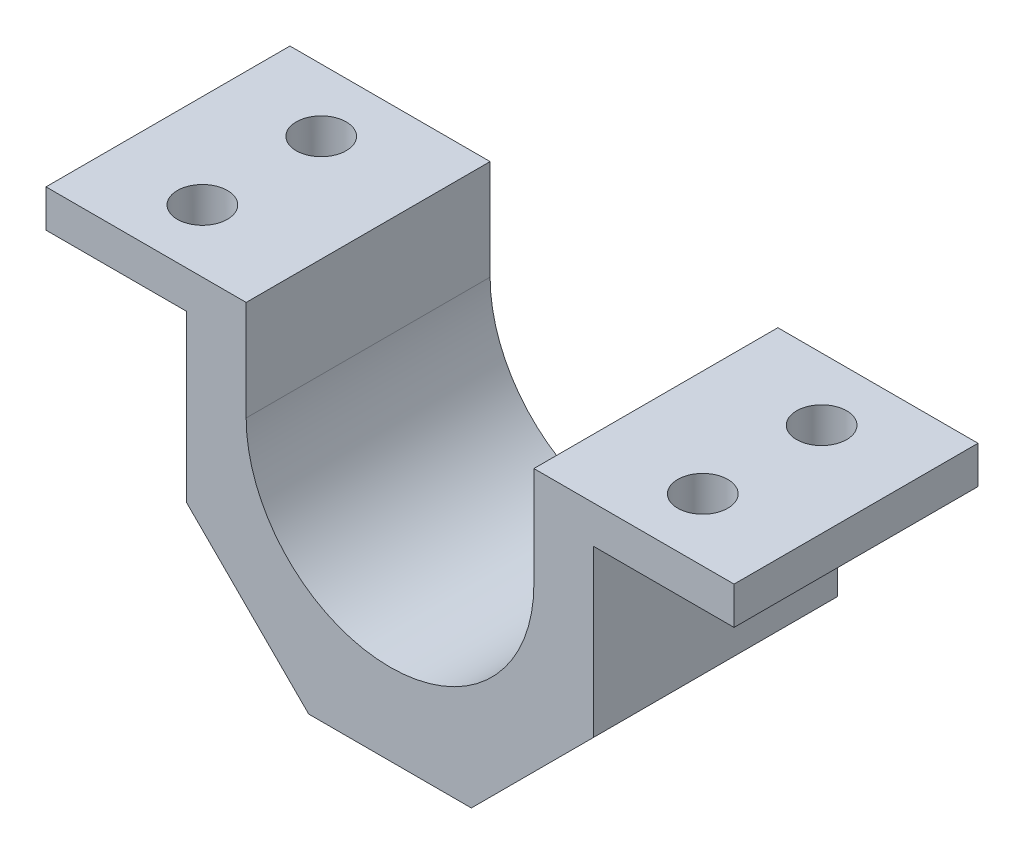
ISO-10303-21;
HEADER;
FILE_DESCRIPTION(('STEP AP214'),'2;1');
FILE_NAME('part.step','',(''),(''),'','','');
FILE_SCHEMA(('AUTOMOTIVE_DESIGN { 1 0 10303 214 1 1 1 1 }'));
ENDSEC;
DATA;
#1=APPLICATION_CONTEXT('core data for automotive mechanical design processes');
#2=APPLICATION_PROTOCOL_DEFINITION('international standard','automotive_design',2000,#1);
#3=PRODUCT_CONTEXT('',#1,'mechanical');
#4=PRODUCT('Part','Part','',(#3));
#5=PRODUCT_RELATED_PRODUCT_CATEGORY('part','',(#4));
#6=PRODUCT_DEFINITION_FORMATION('','',#4);
#7=PRODUCT_DEFINITION_CONTEXT('part definition',#1,'design');
#8=PRODUCT_DEFINITION('design','',#6,#7);
#9=PRODUCT_DEFINITION_SHAPE('','',#8);
#10=(LENGTH_UNIT() NAMED_UNIT(*) SI_UNIT(.MILLI.,.METRE.));
#11=(NAMED_UNIT(*) PLANE_ANGLE_UNIT() SI_UNIT($,.RADIAN.));
#12=(NAMED_UNIT(*) SI_UNIT($,.STERADIAN.) SOLID_ANGLE_UNIT());
#13=UNCERTAINTY_MEASURE_WITH_UNIT(LENGTH_MEASURE(1.E-05),#10,'distance_accuracy_value','');
#14=(GEOMETRIC_REPRESENTATION_CONTEXT(3) GLOBAL_UNCERTAINTY_ASSIGNED_CONTEXT((#13)) GLOBAL_UNIT_ASSIGNED_CONTEXT((#10,
#11,#12)) REPRESENTATION_CONTEXT('',''));
#15=CARTESIAN_POINT('',(0.,0.,0.));
#16=DIRECTION('',(0.,0.,1.));
#17=DIRECTION('',(1.,0.,0.));
#18=AXIS2_PLACEMENT_3D('',#15,#16,#17);
#19=CARTESIAN_POINT('',(-55.,16.,19.5));
#20=DIRECTION('',(1.,0.,0.));
#21=DIRECTION('',(0.,1.,0.));
#22=AXIS2_PLACEMENT_3D('',#19,#20,#21);
#23=PLANE('',#22);
#24=DIRECTION('',(0.,-1.,0.));
#25=VECTOR('',#24,1.);
#26=CARTESIAN_POINT('',(-55.,16.,-19.5));
#27=LINE('',#26,#25);
#28=CARTESIAN_POINT('',(-55.,16.,-19.5));
#29=VERTEX_POINT('',#28);
#30=CARTESIAN_POINT('',(-55.,10.,-19.5));
#31=VERTEX_POINT('',#30);
#32=EDGE_CURVE('E180',#29,#31,#27,.T.);
#33=ORIENTED_EDGE('',*,*,#32,.T.);
#34=DIRECTION('',(0.,0.,-1.));
#35=VECTOR('',#34,1.);
#36=CARTESIAN_POINT('',(-55.,10.,19.5));
#37=LINE('',#36,#35);
#38=CARTESIAN_POINT('',(-55.,10.,19.5));
#39=VERTEX_POINT('',#38);
#40=EDGE_CURVE('E11',#39,#31,#37,.T.);
#41=ORIENTED_EDGE('',*,*,#40,.F.);
#42=DIRECTION('',(0.,-1.,0.));
#43=VECTOR('',#42,1.);
#44=CARTESIAN_POINT('',(-55.,16.,19.5));
#45=LINE('',#44,#43);
#46=CARTESIAN_POINT('',(-55.,16.,19.5));
#47=VERTEX_POINT('',#46);
#48=EDGE_CURVE('E221',#47,#39,#45,.T.);
#49=ORIENTED_EDGE('',*,*,#48,.F.);
#50=DIRECTION('',(0.,0.,-1.));
#51=VECTOR('',#50,1.);
#52=CARTESIAN_POINT('',(-55.,16.,19.5));
#53=LINE('',#52,#51);
#54=EDGE_CURVE('E176',#47,#29,#53,.T.);
#55=ORIENTED_EDGE('',*,*,#54,.T.);
#56=EDGE_LOOP('',(#33,#41,#49,#55));
#57=FACE_BOUND('',#56,.T.);
#58=ADVANCED_FACE('F43',(#57),#23,.F.);
#59=CARTESIAN_POINT('',(-55.,10.,19.5));
#60=DIRECTION('',(0.,1.,0.));
#61=DIRECTION('',(0.,0.,1.));
#62=AXIS2_PLACEMENT_3D('',#59,#60,#61);
#63=PLANE('',#62);
#64=CARTESIAN_POINT('',(-40.,10.,-9.5));
#65=DIRECTION('',(0.,1.,0.));
#66=DIRECTION('',(0.,0.,1.));
#67=AXIS2_PLACEMENT_3D('',#64,#65,#66);
#68=CIRCLE('',#67,4.);
#69=CARTESIAN_POINT('',(-40.,10.,-5.5));
#70=VERTEX_POINT('',#69);
#71=EDGE_CURVE('E552',#70,#70,#68,.T.);
#72=ORIENTED_EDGE('',*,*,#71,.T.);
#73=EDGE_LOOP('',(#72));
#74=FACE_BOUND('',#73,.T.);
#75=CARTESIAN_POINT('',(-40.,10.,9.5));
#76=DIRECTION('',(0.,1.,0.));
#77=DIRECTION('',(0.,0.,1.));
#78=AXIS2_PLACEMENT_3D('',#75,#76,#77);
#79=CIRCLE('',#78,4.);
#80=CARTESIAN_POINT('',(-40.,10.,13.5));
#81=VERTEX_POINT('',#80);
#82=EDGE_CURVE('E562',#81,#81,#79,.T.);
#83=ORIENTED_EDGE('',*,*,#82,.T.);
#84=EDGE_LOOP('',(#83));
#85=FACE_BOUND('',#84,.T.);
#86=DIRECTION('',(1.,0.,0.));
#87=VECTOR('',#86,1.);
#88=CARTESIAN_POINT('',(-55.,10.,-19.5));
#89=LINE('',#88,#87);
#90=CARTESIAN_POINT('',(-32.5,10.,-19.5));
#91=VERTEX_POINT('',#90);
#92=EDGE_CURVE('E184',#31,#91,#89,.T.);
#93=ORIENTED_EDGE('',*,*,#92,.T.);
#94=DIRECTION('',(0.,0.,-1.));
#95=VECTOR('',#94,1.);
#96=CARTESIAN_POINT('',(-32.5,10.,19.5));
#97=LINE('',#96,#95);
#98=CARTESIAN_POINT('',(-32.5,10.,19.5));
#99=VERTEX_POINT('',#98);
#100=EDGE_CURVE('E52',#99,#91,#97,.T.);
#101=ORIENTED_EDGE('',*,*,#100,.F.);
#102=DIRECTION('',(1.,0.,0.));
#103=VECTOR('',#102,1.);
#104=CARTESIAN_POINT('',(-55.,10.,19.5));
#105=LINE('',#104,#103);
#106=EDGE_CURVE('E121',#39,#99,#105,.T.);
#107=ORIENTED_EDGE('',*,*,#106,.F.);
#108=ORIENTED_EDGE('',*,*,#40,.T.);
#109=EDGE_LOOP('',(#93,#101,#107,#108));
#110=FACE_BOUND('',#109,.T.);
#111=ADVANCED_FACE('F332',(#74,#85,#110),#63,.F.);
#112=CARTESIAN_POINT('',(-32.5,10.,19.5));
#113=DIRECTION('',(1.,0.,0.));
#114=DIRECTION('',(0.,0.,-1.));
#115=AXIS2_PLACEMENT_3D('',#112,#113,#114);
#116=PLANE('',#115);
#117=DIRECTION('',(0.,-1.,0.));
#118=VECTOR('',#117,1.);
#119=CARTESIAN_POINT('',(-32.5,10.,-19.5));
#120=LINE('',#119,#118);
#121=CARTESIAN_POINT('',(-32.5,-16.4999999999999,-19.5));
#122=VERTEX_POINT('',#121);
#123=EDGE_CURVE('E188',#91,#122,#120,.T.);
#124=ORIENTED_EDGE('',*,*,#123,.T.);
#125=DIRECTION('',(0.,0.,-1.));
#126=VECTOR('',#125,1.);
#127=CARTESIAN_POINT('',(-32.5,-16.4999999999999,19.5));
#128=LINE('',#127,#126);
#129=CARTESIAN_POINT('',(-32.5,-16.4999999999999,19.5));
#130=VERTEX_POINT('',#129);
#131=EDGE_CURVE('E256',#130,#122,#128,.T.);
#132=ORIENTED_EDGE('',*,*,#131,.F.);
#133=DIRECTION('',(0.,-1.,0.));
#134=VECTOR('',#133,1.);
#135=CARTESIAN_POINT('',(-32.5,10.,19.5));
#136=LINE('',#135,#134);
#137=EDGE_CURVE('E266',#99,#130,#136,.T.);
#138=ORIENTED_EDGE('',*,*,#137,.F.);
#139=ORIENTED_EDGE('',*,*,#100,.T.);
#140=EDGE_LOOP('',(#124,#132,#138,#139));
#141=FACE_BOUND('',#140,.T.);
#142=ADVANCED_FACE('F264',(#141),#116,.F.);
#143=CARTESIAN_POINT('',(-32.5,-16.4999999999999,19.5));
#144=DIRECTION('',(0.707106781186549,0.707106781186546,0.));
#145=DIRECTION('',(-0.707106781186546,0.707106781186549,0.));
#146=AXIS2_PLACEMENT_3D('',#143,#144,#145);
#147=PLANE('',#146);
#148=DIRECTION('',(0.707106781186546,-0.707106781186549,0.));
#149=VECTOR('',#148,1.);
#150=CARTESIAN_POINT('',(-32.5,-16.4999999999999,-19.5));
#151=LINE('',#150,#149);
#152=CARTESIAN_POINT('',(-13.,-36.,-19.5));
#153=VERTEX_POINT('',#152);
#154=EDGE_CURVE('E191',#122,#153,#151,.T.);
#155=ORIENTED_EDGE('',*,*,#154,.T.);
#156=DIRECTION('',(0.,0.,-1.));
#157=VECTOR('',#156,1.);
#158=CARTESIAN_POINT('',(-13.,-36.,19.5));
#159=LINE('',#158,#157);
#160=CARTESIAN_POINT('',(-13.,-36.,19.5));
#161=VERTEX_POINT('',#160);
#162=EDGE_CURVE('E252',#161,#153,#159,.T.);
#163=ORIENTED_EDGE('',*,*,#162,.F.);
#164=DIRECTION('',(0.707106781186546,-0.707106781186549,0.));
#165=VECTOR('',#164,1.);
#166=CARTESIAN_POINT('',(-32.5,-16.4999999999999,19.5));
#167=LINE('',#166,#165);
#168=EDGE_CURVE('E285',#130,#161,#167,.T.);
#169=ORIENTED_EDGE('',*,*,#168,.F.);
#170=ORIENTED_EDGE('',*,*,#131,.T.);
#171=EDGE_LOOP('',(#155,#163,#169,#170));
#172=FACE_BOUND('',#171,.T.);
#173=ADVANCED_FACE('F275',(#172),#147,.F.);
#174=CARTESIAN_POINT('',(-13.,-36.,19.5));
#175=DIRECTION('',(0.,1.,0.));
#176=DIRECTION('',(0.,0.,1.));
#177=AXIS2_PLACEMENT_3D('',#174,#175,#176);
#178=PLANE('',#177);
#179=DIRECTION('',(1.,0.,0.));
#180=VECTOR('',#179,1.);
#181=CARTESIAN_POINT('',(-13.,-36.,-19.5));
#182=LINE('',#181,#180);
#183=CARTESIAN_POINT('',(13.,-36.,-19.5));
#184=VERTEX_POINT('',#183);
#185=EDGE_CURVE('E194',#153,#184,#182,.T.);
#186=ORIENTED_EDGE('',*,*,#185,.T.);
#187=DIRECTION('',(0.,0.,-1.));
#188=VECTOR('',#187,1.);
#189=CARTESIAN_POINT('',(13.,-36.,19.5));
#190=LINE('',#189,#188);
#191=CARTESIAN_POINT('',(13.,-36.,19.5));
#192=VERTEX_POINT('',#191);
#193=EDGE_CURVE('E248',#192,#184,#190,.T.);
#194=ORIENTED_EDGE('',*,*,#193,.F.);
#195=DIRECTION('',(1.,0.,0.));
#196=VECTOR('',#195,1.);
#197=CARTESIAN_POINT('',(-13.,-36.,19.5));
#198=LINE('',#197,#196);
#199=EDGE_CURVE('E281',#161,#192,#198,.T.);
#200=ORIENTED_EDGE('',*,*,#199,.F.);
#201=ORIENTED_EDGE('',*,*,#162,.T.);
#202=EDGE_LOOP('',(#186,#194,#200,#201));
#203=FACE_BOUND('',#202,.T.);
#204=ADVANCED_FACE('F279',(#203),#178,.F.);
#205=CARTESIAN_POINT('',(13.,-36.,19.5));
#206=DIRECTION('',(-0.707106781186549,0.707106781186546,0.));
#207=DIRECTION('',(-0.707106781186546,-0.707106781186549,0.));
#208=AXIS2_PLACEMENT_3D('',#205,#206,#207);
#209=PLANE('',#208);
#210=DIRECTION('',(0.707106781186546,0.707106781186549,0.));
#211=VECTOR('',#210,1.);
#212=CARTESIAN_POINT('',(13.,-36.,-19.5));
#213=LINE('',#212,#211);
#214=CARTESIAN_POINT('',(32.5,-16.4999999999999,-19.5));
#215=VERTEX_POINT('',#214);
#216=EDGE_CURVE('E197',#184,#215,#213,.T.);
#217=ORIENTED_EDGE('',*,*,#216,.T.);
#218=DIRECTION('',(0.,0.,-1.));
#219=VECTOR('',#218,1.);
#220=CARTESIAN_POINT('',(32.5,-16.4999999999999,19.5));
#221=LINE('',#220,#219);
#222=CARTESIAN_POINT('',(32.5,-16.4999999999999,19.5));
#223=VERTEX_POINT('',#222);
#224=EDGE_CURVE('E244',#223,#215,#221,.T.);
#225=ORIENTED_EDGE('',*,*,#224,.F.);
#226=DIRECTION('',(0.707106781186546,0.707106781186549,0.));
#227=VECTOR('',#226,1.);
#228=CARTESIAN_POINT('',(13.,-36.,19.5));
#229=LINE('',#228,#227);
#230=EDGE_CURVE('E284',#192,#223,#229,.T.);
#231=ORIENTED_EDGE('',*,*,#230,.F.);
#232=ORIENTED_EDGE('',*,*,#193,.T.);
#233=EDGE_LOOP('',(#217,#225,#231,#232));
#234=FACE_BOUND('',#233,.T.);
#235=ADVANCED_FACE('F348',(#234),#209,.F.);
#236=CARTESIAN_POINT('',(32.5,-16.4999999999999,19.5));
#237=DIRECTION('',(-1.,0.,0.));
#238=DIRECTION('',(0.,0.,1.));
#239=AXIS2_PLACEMENT_3D('',#236,#237,#238);
#240=PLANE('',#239);
#241=DIRECTION('',(0.,1.,0.));
#242=VECTOR('',#241,1.);
#243=CARTESIAN_POINT('',(32.5,-16.4999999999999,-19.5));
#244=LINE('',#243,#242);
#245=CARTESIAN_POINT('',(32.5,10.,-19.5));
#246=VERTEX_POINT('',#245);
#247=EDGE_CURVE('E200',#215,#246,#244,.T.);
#248=ORIENTED_EDGE('',*,*,#247,.T.);
#249=DIRECTION('',(0.,0.,-1.));
#250=VECTOR('',#249,1.);
#251=CARTESIAN_POINT('',(32.5,10.,19.5));
#252=LINE('',#251,#250);
#253=CARTESIAN_POINT('',(32.5,10.,19.5));
#254=VERTEX_POINT('',#253);
#255=EDGE_CURVE('E240',#254,#246,#252,.T.);
#256=ORIENTED_EDGE('',*,*,#255,.F.);
#257=DIRECTION('',(0.,1.,0.));
#258=VECTOR('',#257,1.);
#259=CARTESIAN_POINT('',(32.5,-16.4999999999999,19.5));
#260=LINE('',#259,#258);
#261=EDGE_CURVE('E289',#223,#254,#260,.T.);
#262=ORIENTED_EDGE('',*,*,#261,.F.);
#263=ORIENTED_EDGE('',*,*,#224,.T.);
#264=EDGE_LOOP('',(#248,#256,#262,#263));
#265=FACE_BOUND('',#264,.T.);
#266=ADVANCED_FACE('F351',(#265),#240,.F.);
#267=CARTESIAN_POINT('',(32.5,10.,19.5));
#268=DIRECTION('',(0.,1.,0.));
#269=DIRECTION('',(0.,0.,1.));
#270=AXIS2_PLACEMENT_3D('',#267,#268,#269);
#271=PLANE('',#270);
#272=CARTESIAN_POINT('',(40.,10.,9.5));
#273=DIRECTION('',(0.,1.,0.));
#274=DIRECTION('',(0.,0.,1.));
#275=AXIS2_PLACEMENT_3D('',#272,#273,#274);
#276=CIRCLE('',#275,4.);
#277=CARTESIAN_POINT('',(40.,10.,13.5));
#278=VERTEX_POINT('',#277);
#279=EDGE_CURVE('E185',#278,#278,#276,.T.);
#280=ORIENTED_EDGE('',*,*,#279,.T.);
#281=EDGE_LOOP('',(#280));
#282=FACE_BOUND('',#281,.T.);
#283=CARTESIAN_POINT('',(40.,10.,-9.5));
#284=DIRECTION('',(0.,1.,0.));
#285=DIRECTION('',(0.,0.,1.));
#286=AXIS2_PLACEMENT_3D('',#283,#284,#285);
#287=CIRCLE('',#286,4.);
#288=CARTESIAN_POINT('',(40.,10.,-5.5));
#289=VERTEX_POINT('',#288);
#290=EDGE_CURVE('E548',#289,#289,#287,.T.);
#291=ORIENTED_EDGE('',*,*,#290,.T.);
#292=EDGE_LOOP('',(#291));
#293=FACE_BOUND('',#292,.T.);
#294=DIRECTION('',(1.,0.,0.));
#295=VECTOR('',#294,1.);
#296=CARTESIAN_POINT('',(32.5,10.,-19.5));
#297=LINE('',#296,#295);
#298=CARTESIAN_POINT('',(55.,10.,-19.5));
#299=VERTEX_POINT('',#298);
#300=EDGE_CURVE('E203',#246,#299,#297,.T.);
#301=ORIENTED_EDGE('',*,*,#300,.T.);
#302=DIRECTION('',(0.,0.,-1.));
#303=VECTOR('',#302,1.);
#304=CARTESIAN_POINT('',(55.,10.,19.5));
#305=LINE('',#304,#303);
#306=CARTESIAN_POINT('',(55.,10.,19.5));
#307=VERTEX_POINT('',#306);
#308=EDGE_CURVE('E236',#307,#299,#305,.T.);
#309=ORIENTED_EDGE('',*,*,#308,.F.);
#310=DIRECTION('',(1.,0.,0.));
#311=VECTOR('',#310,1.);
#312=CARTESIAN_POINT('',(32.5,10.,19.5));
#313=LINE('',#312,#311);
#314=EDGE_CURVE('E296',#254,#307,#313,.T.);
#315=ORIENTED_EDGE('',*,*,#314,.F.);
#316=ORIENTED_EDGE('',*,*,#255,.T.);
#317=EDGE_LOOP('',(#301,#309,#315,#316));
#318=FACE_BOUND('',#317,.T.);
#319=ADVANCED_FACE('F355',(#282,#293,#318),#271,.F.);
#320=CARTESIAN_POINT('',(55.,10.,19.5));
#321=DIRECTION('',(-1.,0.,0.));
#322=DIRECTION('',(0.,-1.,0.));
#323=AXIS2_PLACEMENT_3D('',#320,#321,#322);
#324=PLANE('',#323);
#325=DIRECTION('',(0.,1.,0.));
#326=VECTOR('',#325,1.);
#327=CARTESIAN_POINT('',(55.,10.,-19.5));
#328=LINE('',#327,#326);
#329=CARTESIAN_POINT('',(55.,16.,-19.5));
#330=VERTEX_POINT('',#329);
#331=EDGE_CURVE('E206',#299,#330,#328,.T.);
#332=ORIENTED_EDGE('',*,*,#331,.T.);
#333=DIRECTION('',(0.,0.,-1.));
#334=VECTOR('',#333,1.);
#335=CARTESIAN_POINT('',(55.,16.,19.5));
#336=LINE('',#335,#334);
#337=CARTESIAN_POINT('',(55.,16.,19.5));
#338=VERTEX_POINT('',#337);
#339=EDGE_CURVE('E232',#338,#330,#336,.T.);
#340=ORIENTED_EDGE('',*,*,#339,.F.);
#341=DIRECTION('',(0.,1.,0.));
#342=VECTOR('',#341,1.);
#343=CARTESIAN_POINT('',(55.,10.,19.5));
#344=LINE('',#343,#342);
#345=EDGE_CURVE('E299',#307,#338,#344,.T.);
#346=ORIENTED_EDGE('',*,*,#345,.F.);
#347=ORIENTED_EDGE('',*,*,#308,.T.);
#348=EDGE_LOOP('',(#332,#340,#346,#347));
#349=FACE_BOUND('',#348,.T.);
#350=ADVANCED_FACE('F359',(#349),#324,.F.);
#351=CARTESIAN_POINT('',(23.,16.,19.5));
#352=DIRECTION('',(0.,-1.,0.));
#353=DIRECTION('',(0.,0.,-1.));
#354=AXIS2_PLACEMENT_3D('',#351,#352,#353);
#355=PLANE('',#354);
#356=CARTESIAN_POINT('',(40.,16.,9.5));
#357=DIRECTION('',(0.,1.,0.));
#358=DIRECTION('',(0.,0.,1.));
#359=AXIS2_PLACEMENT_3D('',#356,#357,#358);
#360=CIRCLE('',#359,4.);
#361=CARTESIAN_POINT('',(40.,16.,13.5));
#362=VERTEX_POINT('',#361);
#363=EDGE_CURVE('E544',#362,#362,#360,.T.);
#364=ORIENTED_EDGE('',*,*,#363,.F.);
#365=EDGE_LOOP('',(#364));
#366=FACE_BOUND('',#365,.T.);
#367=CARTESIAN_POINT('',(40.,16.,-9.5));
#368=DIRECTION('',(0.,1.,0.));
#369=DIRECTION('',(0.,0.,1.));
#370=AXIS2_PLACEMENT_3D('',#367,#368,#369);
#371=CIRCLE('',#370,4.);
#372=CARTESIAN_POINT('',(40.,16.,-5.5));
#373=VERTEX_POINT('',#372);
#374=EDGE_CURVE('E566',#373,#373,#371,.T.);
#375=ORIENTED_EDGE('',*,*,#374,.F.);
#376=EDGE_LOOP('',(#375));
#377=FACE_BOUND('',#376,.T.);
#378=DIRECTION('',(-1.,0.,0.));
#379=VECTOR('',#378,1.);
#380=CARTESIAN_POINT('',(23.,16.,-19.5));
#381=LINE('',#380,#379);
#382=CARTESIAN_POINT('',(23.,16.,-19.5));
#383=VERTEX_POINT('',#382);
#384=EDGE_CURVE('E209',#330,#383,#381,.T.);
#385=ORIENTED_EDGE('',*,*,#384,.T.);
#386=DIRECTION('',(0.,0.,-1.));
#387=VECTOR('',#386,1.);
#388=CARTESIAN_POINT('',(23.,16.,19.5));
#389=LINE('',#388,#387);
#390=CARTESIAN_POINT('',(23.,16.,19.5));
#391=VERTEX_POINT('',#390);
#392=EDGE_CURVE('E228',#391,#383,#389,.T.);
#393=ORIENTED_EDGE('',*,*,#392,.F.);
#394=DIRECTION('',(-1.,0.,0.));
#395=VECTOR('',#394,1.);
#396=CARTESIAN_POINT('',(23.,16.,19.5));
#397=LINE('',#396,#395);
#398=EDGE_CURVE('E302',#338,#391,#397,.T.);
#399=ORIENTED_EDGE('',*,*,#398,.F.);
#400=ORIENTED_EDGE('',*,*,#339,.T.);
#401=EDGE_LOOP('',(#385,#393,#399,#400));
#402=FACE_BOUND('',#401,.T.);
#403=ADVANCED_FACE('F310',(#366,#377,#402),#355,.F.);
#404=CARTESIAN_POINT('',(23.,0.,19.5));
#405=DIRECTION('',(1.,0.,0.));
#406=DIRECTION('',(0.,0.,-1.));
#407=AXIS2_PLACEMENT_3D('',#404,#405,#406);
#408=PLANE('',#407);
#409=DIRECTION('',(0.,-1.,0.));
#410=VECTOR('',#409,1.);
#411=CARTESIAN_POINT('',(23.,0.,-19.5));
#412=LINE('',#411,#410);
#413=CARTESIAN_POINT('',(23.,0.,-19.5));
#414=VERTEX_POINT('',#413);
#415=EDGE_CURVE('E212',#383,#414,#412,.T.);
#416=ORIENTED_EDGE('',*,*,#415,.T.);
#417=DIRECTION('',(0.,0.,-1.));
#418=VECTOR('',#417,1.);
#419=CARTESIAN_POINT('',(23.,0.,19.5));
#420=LINE('',#419,#418);
#421=CARTESIAN_POINT('',(23.,0.,19.5));
#422=VERTEX_POINT('',#421);
#423=EDGE_CURVE('E169',#422,#414,#420,.T.);
#424=ORIENTED_EDGE('',*,*,#423,.F.);
#425=DIRECTION('',(0.,-1.,0.));
#426=VECTOR('',#425,1.);
#427=CARTESIAN_POINT('',(23.,0.,19.5));
#428=LINE('',#427,#426);
#429=EDGE_CURVE('E158',#391,#422,#428,.T.);
#430=ORIENTED_EDGE('',*,*,#429,.F.);
#431=ORIENTED_EDGE('',*,*,#392,.T.);
#432=EDGE_LOOP('',(#416,#424,#430,#431));
#433=FACE_BOUND('',#432,.T.);
#434=ADVANCED_FACE('F314',(#433),#408,.F.);
#435=CARTESIAN_POINT('',(0.,0.,19.5));
#436=DIRECTION('',(0.,0.,-1.));
#437=DIRECTION('',(-1.,0.,0.));
#438=AXIS2_PLACEMENT_3D('',#435,#436,#437);
#439=CYLINDRICAL_SURFACE('',#438,23.);
#440=CARTESIAN_POINT('',(0.,0.,-19.5));
#441=DIRECTION('',(0.,0.,-1.));
#442=DIRECTION('',(1.,0.,0.));
#443=AXIS2_PLACEMENT_3D('',#440,#441,#442);
#444=CIRCLE('',#443,23.);
#445=CARTESIAN_POINT('',(-23.,0.,-19.5));
#446=VERTEX_POINT('',#445);
#447=EDGE_CURVE('E167',#414,#446,#444,.T.);
#448=ORIENTED_EDGE('',*,*,#447,.T.);
#449=DIRECTION('',(0.,0.,-1.));
#450=VECTOR('',#449,1.);
#451=CARTESIAN_POINT('',(-23.,0.,19.5));
#452=LINE('',#451,#450);
#453=CARTESIAN_POINT('',(-23.,0.,19.5));
#454=VERTEX_POINT('',#453);
#455=EDGE_CURVE('E164',#454,#446,#452,.T.);
#456=ORIENTED_EDGE('',*,*,#455,.F.);
#457=CARTESIAN_POINT('',(0.,0.,19.5));
#458=DIRECTION('',(0.,0.,-1.));
#459=DIRECTION('',(1.,0.,0.));
#460=AXIS2_PLACEMENT_3D('',#457,#458,#459);
#461=CIRCLE('',#460,23.);
#462=EDGE_CURVE('E152',#422,#454,#461,.T.);
#463=ORIENTED_EDGE('',*,*,#462,.F.);
#464=ORIENTED_EDGE('',*,*,#423,.T.);
#465=EDGE_LOOP('',(#448,#456,#463,#464));
#466=FACE_BOUND('',#465,.T.);
#467=ADVANCED_FACE('F165',(#466),#439,.F.);
#468=CARTESIAN_POINT('',(-23.,0.,19.5));
#469=DIRECTION('',(-1.,0.,0.));
#470=DIRECTION('',(0.,0.,1.));
#471=AXIS2_PLACEMENT_3D('',#468,#469,#470);
#472=PLANE('',#471);
#473=DIRECTION('',(0.,1.,0.));
#474=VECTOR('',#473,1.);
#475=CARTESIAN_POINT('',(-23.,0.,-19.5));
#476=LINE('',#475,#474);
#477=CARTESIAN_POINT('',(-23.,16.,-19.5));
#478=VERTEX_POINT('',#477);
#479=EDGE_CURVE('E107',#446,#478,#476,.T.);
#480=ORIENTED_EDGE('',*,*,#479,.T.);
#481=DIRECTION('',(0.,0.,-1.));
#482=VECTOR('',#481,1.);
#483=CARTESIAN_POINT('',(-23.,16.,19.5));
#484=LINE('',#483,#482);
#485=CARTESIAN_POINT('',(-23.,16.,19.5));
#486=VERTEX_POINT('',#485);
#487=EDGE_CURVE('E170',#486,#478,#484,.T.);
#488=ORIENTED_EDGE('',*,*,#487,.F.);
#489=DIRECTION('',(0.,1.,0.));
#490=VECTOR('',#489,1.);
#491=CARTESIAN_POINT('',(-23.,0.,19.5));
#492=LINE('',#491,#490);
#493=EDGE_CURVE('E156',#454,#486,#492,.T.);
#494=ORIENTED_EDGE('',*,*,#493,.F.);
#495=ORIENTED_EDGE('',*,*,#455,.T.);
#496=EDGE_LOOP('',(#480,#488,#494,#495));
#497=FACE_BOUND('',#496,.T.);
#498=ADVANCED_FACE('F172',(#497),#472,.F.);
#499=CARTESIAN_POINT('',(-55.,16.,19.5));
#500=DIRECTION('',(0.,-1.,0.));
#501=DIRECTION('',(0.,0.,-1.));
#502=AXIS2_PLACEMENT_3D('',#499,#500,#501);
#503=PLANE('',#502);
#504=CARTESIAN_POINT('',(-40.,16.,-9.5));
#505=DIRECTION('',(0.,1.,0.));
#506=DIRECTION('',(0.,0.,-1.));
#507=AXIS2_PLACEMENT_3D('',#504,#505,#506);
#508=CIRCLE('',#507,4.);
#509=CARTESIAN_POINT('',(-40.,16.,-13.5));
#510=VERTEX_POINT('',#509);
#511=EDGE_CURVE('E570',#510,#510,#508,.T.);
#512=ORIENTED_EDGE('',*,*,#511,.F.);
#513=EDGE_LOOP('',(#512));
#514=FACE_BOUND('',#513,.T.);
#515=CARTESIAN_POINT('',(-40.,16.,9.5));
#516=DIRECTION('',(0.,1.,0.));
#517=DIRECTION('',(0.,0.,-1.));
#518=AXIS2_PLACEMENT_3D('',#515,#516,#517);
#519=CIRCLE('',#518,4.);
#520=CARTESIAN_POINT('',(-40.,16.,5.5));
#521=VERTEX_POINT('',#520);
#522=EDGE_CURVE('E574',#521,#521,#519,.T.);
#523=ORIENTED_EDGE('',*,*,#522,.F.);
#524=EDGE_LOOP('',(#523));
#525=FACE_BOUND('',#524,.T.);
#526=DIRECTION('',(-1.,0.,0.));
#527=VECTOR('',#526,1.);
#528=CARTESIAN_POINT('',(-55.,16.,-19.5));
#529=LINE('',#528,#527);
#530=EDGE_CURVE('E113',#478,#29,#529,.T.);
#531=ORIENTED_EDGE('',*,*,#530,.T.);
#532=ORIENTED_EDGE('',*,*,#54,.F.);
#533=DIRECTION('',(-1.,0.,0.));
#534=VECTOR('',#533,1.);
#535=CARTESIAN_POINT('',(-55.,16.,19.5));
#536=LINE('',#535,#534);
#537=EDGE_CURVE('E60',#486,#47,#536,.T.);
#538=ORIENTED_EDGE('',*,*,#537,.F.);
#539=ORIENTED_EDGE('',*,*,#487,.T.);
#540=EDGE_LOOP('',(#531,#532,#538,#539));
#541=FACE_BOUND('',#540,.T.);
#542=ADVANCED_FACE('F318',(#514,#525,#541),#503,.F.);
#543=CARTESIAN_POINT('',(0.,0.,19.5));
#544=DIRECTION('',(0.,0.,1.));
#545=DIRECTION('',(1.,0.,0.));
#546=AXIS2_PLACEMENT_3D('',#543,#544,#545);
#547=PLANE('',#546);
#548=ORIENTED_EDGE('',*,*,#48,.T.);
#549=ORIENTED_EDGE('',*,*,#106,.T.);
#550=ORIENTED_EDGE('',*,*,#137,.T.);
#551=ORIENTED_EDGE('',*,*,#168,.T.);
#552=ORIENTED_EDGE('',*,*,#199,.T.);
#553=ORIENTED_EDGE('',*,*,#230,.T.);
#554=ORIENTED_EDGE('',*,*,#261,.T.);
#555=ORIENTED_EDGE('',*,*,#314,.T.);
#556=ORIENTED_EDGE('',*,*,#345,.T.);
#557=ORIENTED_EDGE('',*,*,#398,.T.);
#558=ORIENTED_EDGE('',*,*,#429,.T.);
#559=ORIENTED_EDGE('',*,*,#462,.T.);
#560=ORIENTED_EDGE('',*,*,#493,.T.);
#561=ORIENTED_EDGE('',*,*,#537,.T.);
#562=EDGE_LOOP('',(#548,#549,#550,#551,#552,#553,#554,#555,#556,#557,#558,#559,#560,#561));
#563=FACE_BOUND('',#562,.T.);
#564=ADVANCED_FACE('F154',(#563),#547,.T.);
#565=CARTESIAN_POINT('',(0.,0.,-19.5));
#566=DIRECTION('',(0.,0.,1.));
#567=DIRECTION('',(1.,0.,0.));
#568=AXIS2_PLACEMENT_3D('',#565,#566,#567);
#569=PLANE('',#568);
#570=ORIENTED_EDGE('',*,*,#32,.F.);
#571=ORIENTED_EDGE('',*,*,#530,.F.);
#572=ORIENTED_EDGE('',*,*,#479,.F.);
#573=ORIENTED_EDGE('',*,*,#447,.F.);
#574=ORIENTED_EDGE('',*,*,#415,.F.);
#575=ORIENTED_EDGE('',*,*,#384,.F.);
#576=ORIENTED_EDGE('',*,*,#331,.F.);
#577=ORIENTED_EDGE('',*,*,#300,.F.);
#578=ORIENTED_EDGE('',*,*,#247,.F.);
#579=ORIENTED_EDGE('',*,*,#216,.F.);
#580=ORIENTED_EDGE('',*,*,#185,.F.);
#581=ORIENTED_EDGE('',*,*,#154,.F.);
#582=ORIENTED_EDGE('',*,*,#123,.F.);
#583=ORIENTED_EDGE('',*,*,#92,.F.);
#584=EDGE_LOOP('',(#570,#571,#572,#573,#574,#575,#576,#577,#578,#579,#580,#581,#582,#583));
#585=FACE_BOUND('',#584,.T.);
#586=ADVANCED_FACE('F270',(#585),#569,.F.);
#587=CARTESIAN_POINT('',(-40.,-23.,9.5));
#588=DIRECTION('',(0.,1.,0.));
#589=DIRECTION('',(0.,0.,1.));
#590=AXIS2_PLACEMENT_3D('',#587,#588,#589);
#591=CYLINDRICAL_SURFACE('',#590,4.);
#592=ORIENTED_EDGE('',*,*,#522,.T.);
#593=EDGE_LOOP('',(#592));
#594=FACE_BOUND('',#593,.T.);
#595=ORIENTED_EDGE('',*,*,#82,.F.);
#596=EDGE_LOOP('',(#595));
#597=FACE_BOUND('',#596,.T.);
#598=ADVANCED_FACE('F395',(#594,#597),#591,.F.);
#599=CARTESIAN_POINT('',(-40.,-23.,-9.5));
#600=DIRECTION('',(0.,1.,0.));
#601=DIRECTION('',(0.,0.,1.));
#602=AXIS2_PLACEMENT_3D('',#599,#600,#601);
#603=CYLINDRICAL_SURFACE('',#602,4.);
#604=ORIENTED_EDGE('',*,*,#511,.T.);
#605=EDGE_LOOP('',(#604));
#606=FACE_BOUND('',#605,.T.);
#607=ORIENTED_EDGE('',*,*,#71,.F.);
#608=EDGE_LOOP('',(#607));
#609=FACE_BOUND('',#608,.T.);
#610=ADVANCED_FACE('F433',(#606,#609),#603,.F.);
#611=CARTESIAN_POINT('',(40.,-23.,-9.5));
#612=DIRECTION('',(0.,1.,0.));
#613=DIRECTION('',(0.,0.,1.));
#614=AXIS2_PLACEMENT_3D('',#611,#612,#613);
#615=CYLINDRICAL_SURFACE('',#614,4.);
#616=ORIENTED_EDGE('',*,*,#374,.T.);
#617=EDGE_LOOP('',(#616));
#618=FACE_BOUND('',#617,.T.);
#619=ORIENTED_EDGE('',*,*,#290,.F.);
#620=EDGE_LOOP('',(#619));
#621=FACE_BOUND('',#620,.T.);
#622=ADVANCED_FACE('F444',(#618,#621),#615,.F.);
#623=CARTESIAN_POINT('',(40.,-23.,9.5));
#624=DIRECTION('',(0.,1.,0.));
#625=DIRECTION('',(0.,0.,1.));
#626=AXIS2_PLACEMENT_3D('',#623,#624,#625);
#627=CYLINDRICAL_SURFACE('',#626,4.);
#628=ORIENTED_EDGE('',*,*,#363,.T.);
#629=EDGE_LOOP('',(#628));
#630=FACE_BOUND('',#629,.T.);
#631=ORIENTED_EDGE('',*,*,#279,.F.);
#632=EDGE_LOOP('',(#631));
#633=FACE_BOUND('',#632,.T.);
#634=ADVANCED_FACE('F455',(#630,#633),#627,.F.);
#635=CLOSED_SHELL('',(#58,#111,#142,#173,#204,#235,#266,#319,#350,#403,#434,#467,#498,#542,#564,
#586,#598,#610,#622,#634));
#636=MANIFOLD_SOLID_BREP('B2',#635);
#637=ADVANCED_BREP_SHAPE_REPRESENTATION('',(#18,#636),#14);
#638=SHAPE_DEFINITION_REPRESENTATION(#9,#637);
ENDSEC;
END-ISO-10303-21;
